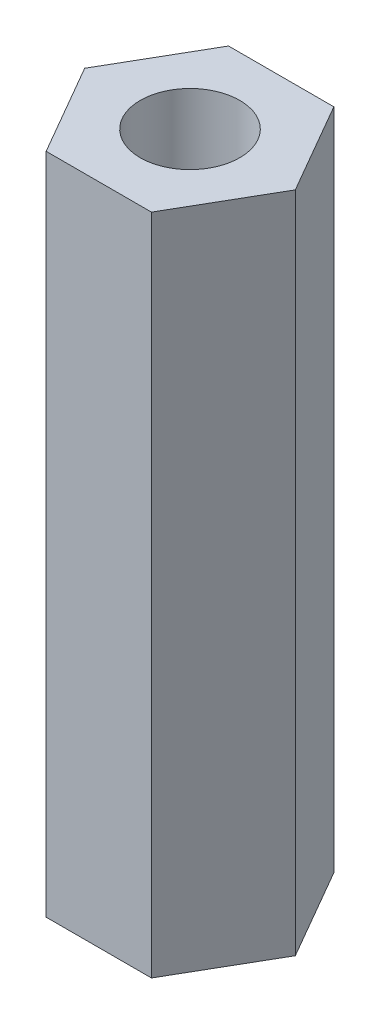
ISO-10303-21;
HEADER;
FILE_DESCRIPTION(('STEP AP214'),'2;1');
FILE_NAME('part.step','',(''),(''),'','','');
FILE_SCHEMA(('AUTOMOTIVE_DESIGN { 1 0 10303 214 1 1 1 1 }'));
ENDSEC;
DATA;
#1=APPLICATION_CONTEXT('core data for automotive mechanical design processes');
#2=APPLICATION_PROTOCOL_DEFINITION('international standard','automotive_design',2000,#1);
#3=PRODUCT_CONTEXT('',#1,'mechanical');
#4=PRODUCT('Part','Part','',(#3));
#5=PRODUCT_RELATED_PRODUCT_CATEGORY('part','',(#4));
#6=PRODUCT_DEFINITION_FORMATION('','',#4);
#7=PRODUCT_DEFINITION_CONTEXT('part definition',#1,'design');
#8=PRODUCT_DEFINITION('design','',#6,#7);
#9=PRODUCT_DEFINITION_SHAPE('','',#8);
#10=(LENGTH_UNIT() NAMED_UNIT(*) SI_UNIT(.MILLI.,.METRE.));
#11=(NAMED_UNIT(*) PLANE_ANGLE_UNIT() SI_UNIT($,.RADIAN.));
#12=(NAMED_UNIT(*) SI_UNIT($,.STERADIAN.) SOLID_ANGLE_UNIT());
#13=UNCERTAINTY_MEASURE_WITH_UNIT(LENGTH_MEASURE(1.E-05),#10,'distance_accuracy_value','');
#14=(GEOMETRIC_REPRESENTATION_CONTEXT(3) GLOBAL_UNCERTAINTY_ASSIGNED_CONTEXT((#13)) GLOBAL_UNIT_ASSIGNED_CONTEXT((#10,
#11,#12)) REPRESENTATION_CONTEXT('',''));
#15=CARTESIAN_POINT('',(0.,0.,0.));
#16=DIRECTION('',(0.,0.,1.));
#17=DIRECTION('',(1.,0.,0.));
#18=AXIS2_PLACEMENT_3D('',#15,#16,#17);
#19=CARTESIAN_POINT('',(0.,20.,0.));
#20=DIRECTION('',(0.,1.,0.));
#21=DIRECTION('',(0.,0.,1.));
#22=AXIS2_PLACEMENT_3D('',#19,#20,#21);
#23=PLANE('',#22);
#24=DIRECTION('',(0.499999999999995,0.,-0.866025403784442));
#25=VECTOR('',#24,1.);
#26=CARTESIAN_POINT('',(1.5877132402715,20.,2.74999999999997));
#27=LINE('',#26,#25);
#28=CARTESIAN_POINT('',(1.5877132402715,20.,2.74999999999997));
#29=VERTEX_POINT('',#28);
#30=CARTESIAN_POINT('',(3.17542648054293,20.,0.));
#31=VERTEX_POINT('',#30);
#32=EDGE_CURVE('E129',#29,#31,#27,.T.);
#33=ORIENTED_EDGE('',*,*,#32,.T.);
#34=DIRECTION('',(-0.500000000000001,0.,-0.866025403784438));
#35=VECTOR('',#34,1.);
#36=CARTESIAN_POINT('',(3.17542648054293,20.,0.));
#37=LINE('',#36,#35);
#38=CARTESIAN_POINT('',(1.58771324027146,20.,-2.74999999999999));
#39=VERTEX_POINT('',#38);
#40=EDGE_CURVE('E87',#31,#39,#37,.T.);
#41=ORIENTED_EDGE('',*,*,#40,.T.);
#42=DIRECTION('',(-1.,0.,0.));
#43=VECTOR('',#42,1.);
#44=CARTESIAN_POINT('',(1.58771324027146,20.,-2.74999999999999));
#45=LINE('',#44,#43);
#46=CARTESIAN_POINT('',(-1.58771324027148,20.,-2.74999999999998));
#47=VERTEX_POINT('',#46);
#48=EDGE_CURVE('E100',#39,#47,#45,.T.);
#49=ORIENTED_EDGE('',*,*,#48,.T.);
#50=DIRECTION('',(-0.499999999999995,0.,0.866025403784441));
#51=VECTOR('',#50,1.);
#52=CARTESIAN_POINT('',(-1.58771324027148,20.,-2.74999999999998));
#53=LINE('',#52,#51);
#54=CARTESIAN_POINT('',(-3.17542648054293,20.,0.));
#55=VERTEX_POINT('',#54);
#56=EDGE_CURVE('E94',#47,#55,#53,.T.);
#57=ORIENTED_EDGE('',*,*,#56,.T.);
#58=DIRECTION('',(0.500000000000007,0.,0.866025403784435));
#59=VECTOR('',#58,1.);
#60=CARTESIAN_POINT('',(-3.17542648054293,20.,0.));
#61=LINE('',#60,#59);
#62=CARTESIAN_POINT('',(-1.58771324027144,20.,2.75));
#63=VERTEX_POINT('',#62);
#64=EDGE_CURVE('E98',#55,#63,#61,.T.);
#65=ORIENTED_EDGE('',*,*,#64,.T.);
#66=DIRECTION('',(1.,0.,0.));
#67=VECTOR('',#66,1.);
#68=CARTESIAN_POINT('',(-1.58771324027144,20.,2.75));
#69=LINE('',#68,#67);
#70=EDGE_CURVE('E50',#63,#29,#69,.T.);
#71=ORIENTED_EDGE('',*,*,#70,.T.);
#72=EDGE_LOOP('',(#33,#41,#49,#57,#65,#71));
#73=FACE_BOUND('',#72,.T.);
#74=CARTESIAN_POINT('',(0.,20.,0.));
#75=DIRECTION('',(0.,1.,0.));
#76=DIRECTION('',(0.,0.,1.));
#77=AXIS2_PLACEMENT_3D('',#74,#75,#76);
#78=CIRCLE('',#77,1.5);
#79=CARTESIAN_POINT('',(0.,20.,1.5));
#80=VERTEX_POINT('',#79);
#81=EDGE_CURVE('E122',#80,#80,#78,.T.);
#82=ORIENTED_EDGE('',*,*,#81,.F.);
#83=EDGE_LOOP('',(#82));
#84=FACE_BOUND('',#83,.T.);
#85=ADVANCED_FACE('F33',(#73,#84),#23,.T.);
#86=CARTESIAN_POINT('',(0.,0.,0.));
#87=DIRECTION('',(0.,1.,0.));
#88=DIRECTION('',(0.,0.,1.));
#89=AXIS2_PLACEMENT_3D('',#86,#87,#88);
#90=PLANE('',#89);
#91=DIRECTION('',(0.499999999999995,0.,-0.866025403784442));
#92=VECTOR('',#91,1.);
#93=CARTESIAN_POINT('',(1.5877132402715,0.,2.74999999999997));
#94=LINE('',#93,#92);
#95=CARTESIAN_POINT('',(1.5877132402715,0.,2.74999999999997));
#96=VERTEX_POINT('',#95);
#97=CARTESIAN_POINT('',(3.17542648054293,0.,0.));
#98=VERTEX_POINT('',#97);
#99=EDGE_CURVE('E118',#96,#98,#94,.T.);
#100=ORIENTED_EDGE('',*,*,#99,.F.);
#101=DIRECTION('',(1.,0.,0.));
#102=VECTOR('',#101,1.);
#103=CARTESIAN_POINT('',(-1.58771324027144,0.,2.75));
#104=LINE('',#103,#102);
#105=CARTESIAN_POINT('',(-1.58771324027144,0.,2.75));
#106=VERTEX_POINT('',#105);
#107=EDGE_CURVE('E79',#106,#96,#104,.T.);
#108=ORIENTED_EDGE('',*,*,#107,.F.);
#109=DIRECTION('',(0.500000000000007,0.,0.866025403784435));
#110=VECTOR('',#109,1.);
#111=CARTESIAN_POINT('',(-3.17542648054293,0.,0.));
#112=LINE('',#111,#110);
#113=CARTESIAN_POINT('',(-3.17542648054293,0.,0.));
#114=VERTEX_POINT('',#113);
#115=EDGE_CURVE('E73',#114,#106,#112,.T.);
#116=ORIENTED_EDGE('',*,*,#115,.F.);
#117=DIRECTION('',(-0.499999999999995,0.,0.866025403784441));
#118=VECTOR('',#117,1.);
#119=CARTESIAN_POINT('',(-1.58771324027148,0.,-2.74999999999998));
#120=LINE('',#119,#118);
#121=CARTESIAN_POINT('',(-1.58771324027148,0.,-2.74999999999998));
#122=VERTEX_POINT('',#121);
#123=EDGE_CURVE('E108',#122,#114,#120,.T.);
#124=ORIENTED_EDGE('',*,*,#123,.F.);
#125=DIRECTION('',(-1.,0.,0.));
#126=VECTOR('',#125,1.);
#127=CARTESIAN_POINT('',(1.58771324027146,0.,-2.74999999999999));
#128=LINE('',#127,#126);
#129=CARTESIAN_POINT('',(1.58771324027146,0.,-2.74999999999999));
#130=VERTEX_POINT('',#129);
#131=EDGE_CURVE('E124',#130,#122,#128,.T.);
#132=ORIENTED_EDGE('',*,*,#131,.F.);
#133=DIRECTION('',(-0.500000000000001,0.,-0.866025403784438));
#134=VECTOR('',#133,1.);
#135=CARTESIAN_POINT('',(3.17542648054293,0.,0.));
#136=LINE('',#135,#134);
#137=EDGE_CURVE('E121',#98,#130,#136,.T.);
#138=ORIENTED_EDGE('',*,*,#137,.F.);
#139=EDGE_LOOP('',(#100,#108,#116,#124,#132,#138));
#140=FACE_BOUND('',#139,.T.);
#141=CARTESIAN_POINT('',(0.,0.,0.));
#142=DIRECTION('',(0.,1.,0.));
#143=DIRECTION('',(0.,0.,1.));
#144=AXIS2_PLACEMENT_3D('',#141,#142,#143);
#145=CIRCLE('',#144,1.5);
#146=CARTESIAN_POINT('',(0.,0.,1.5));
#147=VERTEX_POINT('',#146);
#148=EDGE_CURVE('E222',#147,#147,#145,.T.);
#149=ORIENTED_EDGE('',*,*,#148,.T.);
#150=EDGE_LOOP('',(#149));
#151=FACE_BOUND('',#150,.T.);
#152=ADVANCED_FACE('F138',(#140,#151),#90,.F.);
#153=CARTESIAN_POINT('',(1.5877132402715,20.,2.74999999999997));
#154=DIRECTION('',(-0.866025403784442,0.,-0.499999999999995));
#155=DIRECTION('',(-0.499999999999995,0.,0.866025403784442));
#156=AXIS2_PLACEMENT_3D('',#153,#154,#155);
#157=PLANE('',#156);
#158=ORIENTED_EDGE('',*,*,#99,.T.);
#159=DIRECTION('',(0.,-1.,0.));
#160=VECTOR('',#159,1.);
#161=CARTESIAN_POINT('',(3.17542648054293,20.,0.));
#162=LINE('',#161,#160);
#163=EDGE_CURVE('E11',#31,#98,#162,.T.);
#164=ORIENTED_EDGE('',*,*,#163,.F.);
#165=ORIENTED_EDGE('',*,*,#32,.F.);
#166=DIRECTION('',(0.,-1.,0.));
#167=VECTOR('',#166,1.);
#168=CARTESIAN_POINT('',(1.5877132402715,20.,2.74999999999997));
#169=LINE('',#168,#167);
#170=EDGE_CURVE('E114',#29,#96,#169,.T.);
#171=ORIENTED_EDGE('',*,*,#170,.T.);
#172=EDGE_LOOP('',(#158,#164,#165,#171));
#173=FACE_BOUND('',#172,.T.);
#174=ADVANCED_FACE('F35',(#173),#157,.F.);
#175=CARTESIAN_POINT('',(3.17542648054293,20.,0.));
#176=DIRECTION('',(-0.866025403784438,0.,0.500000000000001));
#177=DIRECTION('',(0.500000000000001,0.,0.866025403784438));
#178=AXIS2_PLACEMENT_3D('',#175,#176,#177);
#179=PLANE('',#178);
#180=ORIENTED_EDGE('',*,*,#137,.T.);
#181=DIRECTION('',(0.,-1.,0.));
#182=VECTOR('',#181,1.);
#183=CARTESIAN_POINT('',(1.58771324027146,20.,-2.74999999999999));
#184=LINE('',#183,#182);
#185=EDGE_CURVE('E42',#39,#130,#184,.T.);
#186=ORIENTED_EDGE('',*,*,#185,.F.);
#187=ORIENTED_EDGE('',*,*,#40,.F.);
#188=ORIENTED_EDGE('',*,*,#163,.T.);
#189=EDGE_LOOP('',(#180,#186,#187,#188));
#190=FACE_BOUND('',#189,.T.);
#191=ADVANCED_FACE('F163',(#190),#179,.F.);
#192=CARTESIAN_POINT('',(1.58771324027146,20.,-2.74999999999999));
#193=DIRECTION('',(0.,0.,1.));
#194=DIRECTION('',(1.,0.,0.));
#195=AXIS2_PLACEMENT_3D('',#192,#193,#194);
#196=PLANE('',#195);
#197=ORIENTED_EDGE('',*,*,#131,.T.);
#198=DIRECTION('',(0.,-1.,0.));
#199=VECTOR('',#198,1.);
#200=CARTESIAN_POINT('',(-1.58771324027148,20.,-2.74999999999998));
#201=LINE('',#200,#199);
#202=EDGE_CURVE('E109',#47,#122,#201,.T.);
#203=ORIENTED_EDGE('',*,*,#202,.F.);
#204=ORIENTED_EDGE('',*,*,#48,.F.);
#205=ORIENTED_EDGE('',*,*,#185,.T.);
#206=EDGE_LOOP('',(#197,#203,#204,#205));
#207=FACE_BOUND('',#206,.T.);
#208=ADVANCED_FACE('F135',(#207),#196,.F.);
#209=CARTESIAN_POINT('',(-1.58771324027148,20.,-2.74999999999998));
#210=DIRECTION('',(0.866025403784442,0.,0.499999999999995));
#211=DIRECTION('',(0.499999999999995,0.,-0.866025403784442));
#212=AXIS2_PLACEMENT_3D('',#209,#210,#211);
#213=PLANE('',#212);
#214=ORIENTED_EDGE('',*,*,#123,.T.);
#215=DIRECTION('',(0.,-1.,0.));
#216=VECTOR('',#215,1.);
#217=CARTESIAN_POINT('',(-3.17542648054293,20.,0.));
#218=LINE('',#217,#216);
#219=EDGE_CURVE('E105',#55,#114,#218,.T.);
#220=ORIENTED_EDGE('',*,*,#219,.F.);
#221=ORIENTED_EDGE('',*,*,#56,.F.);
#222=ORIENTED_EDGE('',*,*,#202,.T.);
#223=EDGE_LOOP('',(#214,#220,#221,#222));
#224=FACE_BOUND('',#223,.T.);
#225=ADVANCED_FACE('F106',(#224),#213,.F.);
#226=CARTESIAN_POINT('',(-3.17542648054293,20.,0.));
#227=DIRECTION('',(0.866025403784435,0.,-0.500000000000007));
#228=DIRECTION('',(-0.500000000000007,0.,-0.866025403784435));
#229=AXIS2_PLACEMENT_3D('',#226,#227,#228);
#230=PLANE('',#229);
#231=ORIENTED_EDGE('',*,*,#115,.T.);
#232=DIRECTION('',(0.,-1.,0.));
#233=VECTOR('',#232,1.);
#234=CARTESIAN_POINT('',(-1.58771324027144,20.,2.75));
#235=LINE('',#234,#233);
#236=EDGE_CURVE('E110',#63,#106,#235,.T.);
#237=ORIENTED_EDGE('',*,*,#236,.F.);
#238=ORIENTED_EDGE('',*,*,#64,.F.);
#239=ORIENTED_EDGE('',*,*,#219,.T.);
#240=EDGE_LOOP('',(#231,#237,#238,#239));
#241=FACE_BOUND('',#240,.T.);
#242=ADVANCED_FACE('F112',(#241),#230,.F.);
#243=CARTESIAN_POINT('',(-1.58771324027144,20.,2.75));
#244=DIRECTION('',(0.,0.,-1.));
#245=DIRECTION('',(-1.,0.,0.));
#246=AXIS2_PLACEMENT_3D('',#243,#244,#245);
#247=PLANE('',#246);
#248=ORIENTED_EDGE('',*,*,#107,.T.);
#249=ORIENTED_EDGE('',*,*,#170,.F.);
#250=ORIENTED_EDGE('',*,*,#70,.F.);
#251=ORIENTED_EDGE('',*,*,#236,.T.);
#252=EDGE_LOOP('',(#248,#249,#250,#251));
#253=FACE_BOUND('',#252,.T.);
#254=ADVANCED_FACE('F143',(#253),#247,.F.);
#255=CARTESIAN_POINT('',(0.,20.,0.));
#256=DIRECTION('',(0.,-1.,0.));
#257=DIRECTION('',(0.,0.,-1.));
#258=AXIS2_PLACEMENT_3D('',#255,#256,#257);
#259=CYLINDRICAL_SURFACE('',#258,1.5);
#260=ORIENTED_EDGE('',*,*,#81,.T.);
#261=EDGE_LOOP('',(#260));
#262=FACE_BOUND('',#261,.T.);
#263=ORIENTED_EDGE('',*,*,#148,.F.);
#264=EDGE_LOOP('',(#263));
#265=FACE_BOUND('',#264,.T.);
#266=ADVANCED_FACE('F145',(#262,#265),#259,.F.);
#267=CLOSED_SHELL('',(#85,#152,#174,#191,#208,#225,#242,#254,#266));
#268=MANIFOLD_SOLID_BREP('B2',#267);
#269=ADVANCED_BREP_SHAPE_REPRESENTATION('',(#18,#268),#14);
#270=SHAPE_DEFINITION_REPRESENTATION(#9,#269);
ENDSEC;
END-ISO-10303-21;
